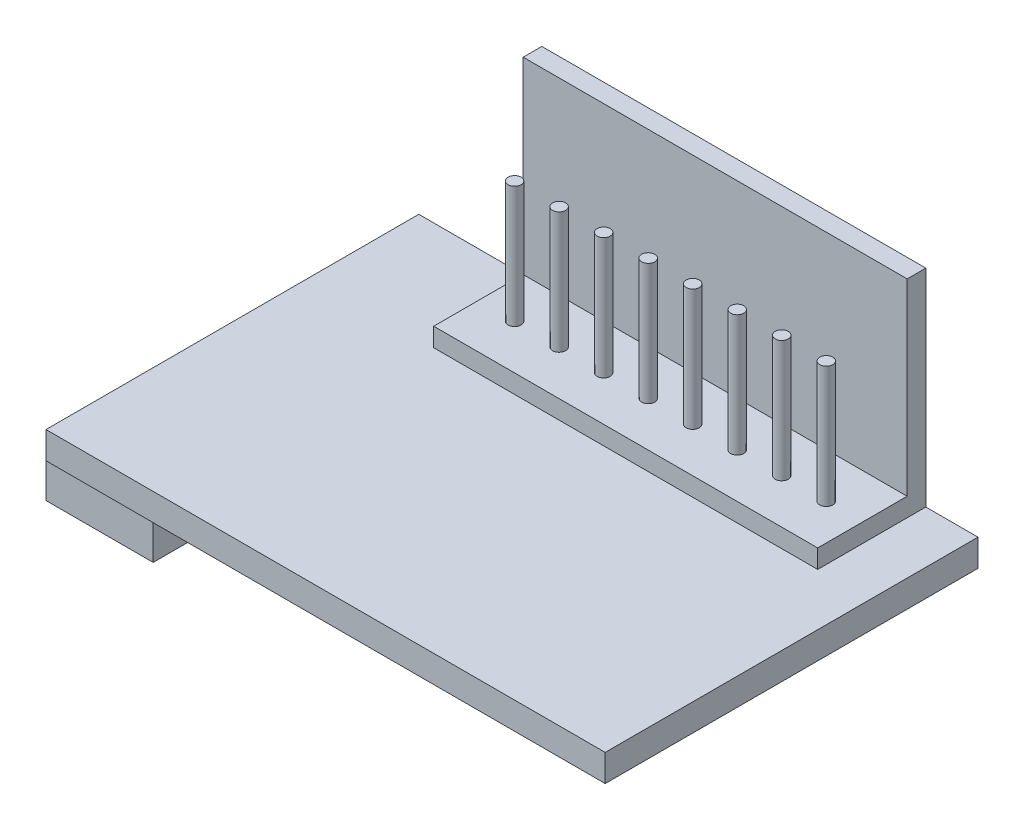
ISO-10303-21;
HEADER;
FILE_DESCRIPTION(('STEP AP214'),'2;1');
FILE_NAME('part.step','',(''),(''),'','','');
FILE_SCHEMA(('AUTOMOTIVE_DESIGN { 1 0 10303 214 1 1 1 1 }'));
ENDSEC;
DATA;
#1=APPLICATION_CONTEXT('core data for automotive mechanical design processes');
#2=APPLICATION_PROTOCOL_DEFINITION('international standard','automotive_design',2000,#1);
#3=PRODUCT_CONTEXT('',#1,'mechanical');
#4=PRODUCT('Part','Part','',(#3));
#5=PRODUCT_RELATED_PRODUCT_CATEGORY('part','',(#4));
#6=PRODUCT_DEFINITION_FORMATION('','',#4);
#7=PRODUCT_DEFINITION_CONTEXT('part definition',#1,'design');
#8=PRODUCT_DEFINITION('design','',#6,#7);
#9=PRODUCT_DEFINITION_SHAPE('','',#8);
#10=(LENGTH_UNIT() NAMED_UNIT(*) SI_UNIT(.MILLI.,.METRE.));
#11=(NAMED_UNIT(*) PLANE_ANGLE_UNIT() SI_UNIT($,.RADIAN.));
#12=(NAMED_UNIT(*) SI_UNIT($,.STERADIAN.) SOLID_ANGLE_UNIT());
#13=UNCERTAINTY_MEASURE_WITH_UNIT(LENGTH_MEASURE(1.E-05),#10,'distance_accuracy_value','');
#14=(GEOMETRIC_REPRESENTATION_CONTEXT(3) GLOBAL_UNCERTAINTY_ASSIGNED_CONTEXT((#13)) GLOBAL_UNIT_ASSIGNED_CONTEXT((#10,
#11,#12)) REPRESENTATION_CONTEXT('',''));
#15=CARTESIAN_POINT('',(0.,0.,0.));
#16=DIRECTION('',(0.,0.,1.));
#17=DIRECTION('',(1.,0.,0.));
#18=AXIS2_PLACEMENT_3D('',#15,#16,#17);
#19=CARTESIAN_POINT('',(25.2605506708399,8.97,-16.6));
#20=DIRECTION('',(0.,-1.,0.));
#21=DIRECTION('',(0.,0.,-1.));
#22=AXIS2_PLACEMENT_3D('',#19,#20,#21);
#23=CYLINDRICAL_SURFACE('',#22,0.350000000000001);
#24=CARTESIAN_POINT('',(25.2605506708399,8.97,-16.6));
#25=DIRECTION('',(0.,1.,0.));
#26=DIRECTION('',(0.,0.,1.));
#27=AXIS2_PLACEMENT_3D('',#24,#25,#26);
#28=CIRCLE('',#27,0.350000000000001);
#29=CARTESIAN_POINT('',(25.2605506708399,8.97,-16.25));
#30=VERTEX_POINT('',#29);
#31=EDGE_CURVE('E11',#30,#30,#28,.T.);
#32=ORIENTED_EDGE('',*,*,#31,.F.);
#33=EDGE_LOOP('',(#32));
#34=FACE_BOUND('',#33,.T.);
#35=CARTESIAN_POINT('',(25.2605506708399,2.45,-16.6));
#36=DIRECTION('',(0.,1.,0.));
#37=DIRECTION('',(0.,0.,1.));
#38=AXIS2_PLACEMENT_3D('',#35,#36,#37);
#39=CIRCLE('',#38,0.350000000000001);
#40=CARTESIAN_POINT('',(25.2605506708399,2.45,-16.25));
#41=VERTEX_POINT('',#40);
#42=EDGE_CURVE('E47',#41,#41,#39,.T.);
#43=ORIENTED_EDGE('',*,*,#42,.T.);
#44=EDGE_LOOP('',(#43));
#45=FACE_BOUND('',#44,.T.);
#46=ADVANCED_FACE('F44',(#34,#45),#23,.T.);
#47=CARTESIAN_POINT('',(25.2605506708399,8.97,-16.6));
#48=DIRECTION('',(0.,1.,0.));
#49=DIRECTION('',(0.,0.,1.));
#50=AXIS2_PLACEMENT_3D('',#47,#48,#49);
#51=PLANE('',#50);
#52=ORIENTED_EDGE('',*,*,#31,.T.);
#53=EDGE_LOOP('',(#52));
#54=FACE_BOUND('',#53,.T.);
#55=ADVANCED_FACE('F59',(#54),#51,.T.);
#56=CARTESIAN_POINT('',(25.2605506708399,2.45,-16.6));
#57=DIRECTION('',(0.,1.,0.));
#58=DIRECTION('',(0.,0.,1.));
#59=AXIS2_PLACEMENT_3D('',#56,#57,#58);
#60=PLANE('',#59);
#61=ORIENTED_EDGE('',*,*,#42,.F.);
#62=EDGE_LOOP('',(#61));
#63=FACE_BOUND('',#62,.T.);
#64=ADVANCED_FACE('F57',(#63),#60,.F.);
#65=CLOSED_SHELL('',(#46,#55,#64));
#66=MANIFOLD_SOLID_BREP('B2',#65);
#67=CARTESIAN_POINT('',(22.8718219077427,8.97,-16.6));
#68=DIRECTION('',(0.,-1.,0.));
#69=DIRECTION('',(0.,0.,-1.));
#70=AXIS2_PLACEMENT_3D('',#67,#68,#69);
#71=CYLINDRICAL_SURFACE('',#70,0.350000000000001);
#72=CARTESIAN_POINT('',(22.8718219077427,8.97,-16.6));
#73=DIRECTION('',(0.,1.,0.));
#74=DIRECTION('',(0.,0.,1.));
#75=AXIS2_PLACEMENT_3D('',#72,#73,#74);
#76=CIRCLE('',#75,0.350000000000001);
#77=CARTESIAN_POINT('',(22.8718219077427,8.97,-16.25));
#78=VERTEX_POINT('',#77);
#79=EDGE_CURVE('E43',#78,#78,#76,.T.);
#80=ORIENTED_EDGE('',*,*,#79,.F.);
#81=EDGE_LOOP('',(#80));
#82=FACE_BOUND('',#81,.T.);
#83=CARTESIAN_POINT('',(22.8718219077427,2.45,-16.6));
#84=DIRECTION('',(0.,1.,0.));
#85=DIRECTION('',(0.,0.,1.));
#86=AXIS2_PLACEMENT_3D('',#83,#84,#85);
#87=CIRCLE('',#86,0.350000000000001);
#88=CARTESIAN_POINT('',(22.8718219077427,2.45,-16.25));
#89=VERTEX_POINT('',#88);
#90=EDGE_CURVE('E96',#89,#89,#87,.T.);
#91=ORIENTED_EDGE('',*,*,#90,.T.);
#92=EDGE_LOOP('',(#91));
#93=FACE_BOUND('',#92,.T.);
#94=ADVANCED_FACE('F93',(#82,#93),#71,.T.);
#95=CARTESIAN_POINT('',(22.8718219077427,8.97,-16.6));
#96=DIRECTION('',(0.,1.,0.));
#97=DIRECTION('',(0.,0.,1.));
#98=AXIS2_PLACEMENT_3D('',#95,#96,#97);
#99=PLANE('',#98);
#100=ORIENTED_EDGE('',*,*,#79,.T.);
#101=EDGE_LOOP('',(#100));
#102=FACE_BOUND('',#101,.T.);
#103=ADVANCED_FACE('F108',(#102),#99,.T.);
#104=CARTESIAN_POINT('',(22.8718219077427,2.45,-16.6));
#105=DIRECTION('',(0.,1.,0.));
#106=DIRECTION('',(0.,0.,1.));
#107=AXIS2_PLACEMENT_3D('',#104,#105,#106);
#108=PLANE('',#107);
#109=ORIENTED_EDGE('',*,*,#90,.F.);
#110=EDGE_LOOP('',(#109));
#111=FACE_BOUND('',#110,.T.);
#112=ADVANCED_FACE('F106',(#111),#108,.F.);
#113=CLOSED_SHELL('',(#94,#103,#112));
#114=MANIFOLD_SOLID_BREP('B6',#113);
#115=CARTESIAN_POINT('',(20.4830931446457,8.97,-16.6));
#116=DIRECTION('',(0.,-1.,0.));
#117=DIRECTION('',(0.,0.,-1.));
#118=AXIS2_PLACEMENT_3D('',#115,#116,#117);
#119=CYLINDRICAL_SURFACE('',#118,0.350000000000001);
#120=CARTESIAN_POINT('',(20.4830931446457,8.97,-16.6));
#121=DIRECTION('',(0.,1.,0.));
#122=DIRECTION('',(0.,0.,1.));
#123=AXIS2_PLACEMENT_3D('',#120,#121,#122);
#124=CIRCLE('',#123,0.350000000000001);
#125=CARTESIAN_POINT('',(20.4830931446457,8.97,-16.25));
#126=VERTEX_POINT('',#125);
#127=EDGE_CURVE('E92',#126,#126,#124,.T.);
#128=ORIENTED_EDGE('',*,*,#127,.F.);
#129=EDGE_LOOP('',(#128));
#130=FACE_BOUND('',#129,.T.);
#131=CARTESIAN_POINT('',(20.4830931446457,2.45,-16.6));
#132=DIRECTION('',(0.,1.,0.));
#133=DIRECTION('',(0.,0.,1.));
#134=AXIS2_PLACEMENT_3D('',#131,#132,#133);
#135=CIRCLE('',#134,0.350000000000001);
#136=CARTESIAN_POINT('',(20.4830931446457,2.45,-16.25));
#137=VERTEX_POINT('',#136);
#138=EDGE_CURVE('E145',#137,#137,#135,.T.);
#139=ORIENTED_EDGE('',*,*,#138,.T.);
#140=EDGE_LOOP('',(#139));
#141=FACE_BOUND('',#140,.T.);
#142=ADVANCED_FACE('F142',(#130,#141),#119,.T.);
#143=CARTESIAN_POINT('',(20.4830931446457,8.97,-16.6));
#144=DIRECTION('',(0.,1.,0.));
#145=DIRECTION('',(0.,0.,1.));
#146=AXIS2_PLACEMENT_3D('',#143,#144,#145);
#147=PLANE('',#146);
#148=ORIENTED_EDGE('',*,*,#127,.T.);
#149=EDGE_LOOP('',(#148));
#150=FACE_BOUND('',#149,.T.);
#151=ADVANCED_FACE('F157',(#150),#147,.T.);
#152=CARTESIAN_POINT('',(20.4830931446457,2.45,-16.6));
#153=DIRECTION('',(0.,1.,0.));
#154=DIRECTION('',(0.,0.,1.));
#155=AXIS2_PLACEMENT_3D('',#152,#153,#154);
#156=PLANE('',#155);
#157=ORIENTED_EDGE('',*,*,#138,.F.);
#158=EDGE_LOOP('',(#157));
#159=FACE_BOUND('',#158,.T.);
#160=ADVANCED_FACE('F155',(#159),#156,.F.);
#161=CLOSED_SHELL('',(#142,#151,#160));
#162=MANIFOLD_SOLID_BREP('B38',#161);
#163=CARTESIAN_POINT('',(18.0943643815486,8.97,-16.6));
#164=DIRECTION('',(0.,-1.,0.));
#165=DIRECTION('',(0.,0.,-1.));
#166=AXIS2_PLACEMENT_3D('',#163,#164,#165);
#167=CYLINDRICAL_SURFACE('',#166,0.350000000000001);
#168=CARTESIAN_POINT('',(18.0943643815486,8.97,-16.6));
#169=DIRECTION('',(0.,1.,0.));
#170=DIRECTION('',(0.,0.,1.));
#171=AXIS2_PLACEMENT_3D('',#168,#169,#170);
#172=CIRCLE('',#171,0.350000000000001);
#173=CARTESIAN_POINT('',(18.0943643815486,8.97,-16.25));
#174=VERTEX_POINT('',#173);
#175=EDGE_CURVE('E141',#174,#174,#172,.T.);
#176=ORIENTED_EDGE('',*,*,#175,.F.);
#177=EDGE_LOOP('',(#176));
#178=FACE_BOUND('',#177,.T.);
#179=CARTESIAN_POINT('',(18.0943643815486,2.45,-16.6));
#180=DIRECTION('',(0.,1.,0.));
#181=DIRECTION('',(0.,0.,1.));
#182=AXIS2_PLACEMENT_3D('',#179,#180,#181);
#183=CIRCLE('',#182,0.350000000000001);
#184=CARTESIAN_POINT('',(18.0943643815486,2.45,-16.25));
#185=VERTEX_POINT('',#184);
#186=EDGE_CURVE('E194',#185,#185,#183,.T.);
#187=ORIENTED_EDGE('',*,*,#186,.T.);
#188=EDGE_LOOP('',(#187));
#189=FACE_BOUND('',#188,.T.);
#190=ADVANCED_FACE('F191',(#178,#189),#167,.T.);
#191=CARTESIAN_POINT('',(18.0943643815486,8.97,-16.6));
#192=DIRECTION('',(0.,1.,0.));
#193=DIRECTION('',(0.,0.,1.));
#194=AXIS2_PLACEMENT_3D('',#191,#192,#193);
#195=PLANE('',#194);
#196=ORIENTED_EDGE('',*,*,#175,.T.);
#197=EDGE_LOOP('',(#196));
#198=FACE_BOUND('',#197,.T.);
#199=ADVANCED_FACE('F206',(#198),#195,.T.);
#200=CARTESIAN_POINT('',(18.0943643815486,2.45,-16.6));
#201=DIRECTION('',(0.,1.,0.));
#202=DIRECTION('',(0.,0.,1.));
#203=AXIS2_PLACEMENT_3D('',#200,#201,#202);
#204=PLANE('',#203);
#205=ORIENTED_EDGE('',*,*,#186,.F.);
#206=EDGE_LOOP('',(#205));
#207=FACE_BOUND('',#206,.T.);
#208=ADVANCED_FACE('F204',(#207),#204,.F.);
#209=CLOSED_SHELL('',(#190,#199,#208));
#210=MANIFOLD_SOLID_BREP('B87',#209);
#211=CARTESIAN_POINT('',(15.7056356184514,8.97,-16.6));
#212=DIRECTION('',(0.,-1.,0.));
#213=DIRECTION('',(0.,0.,-1.));
#214=AXIS2_PLACEMENT_3D('',#211,#212,#213);
#215=CYLINDRICAL_SURFACE('',#214,0.350000000000001);
#216=CARTESIAN_POINT('',(15.7056356184514,8.97,-16.6));
#217=DIRECTION('',(0.,1.,0.));
#218=DIRECTION('',(0.,0.,1.));
#219=AXIS2_PLACEMENT_3D('',#216,#217,#218);
#220=CIRCLE('',#219,0.350000000000001);
#221=CARTESIAN_POINT('',(15.7056356184514,8.97,-16.25));
#222=VERTEX_POINT('',#221);
#223=EDGE_CURVE('E190',#222,#222,#220,.T.);
#224=ORIENTED_EDGE('',*,*,#223,.F.);
#225=EDGE_LOOP('',(#224));
#226=FACE_BOUND('',#225,.T.);
#227=CARTESIAN_POINT('',(15.7056356184514,2.45,-16.6));
#228=DIRECTION('',(0.,1.,0.));
#229=DIRECTION('',(0.,0.,1.));
#230=AXIS2_PLACEMENT_3D('',#227,#228,#229);
#231=CIRCLE('',#230,0.350000000000001);
#232=CARTESIAN_POINT('',(15.7056356184514,2.45,-16.25));
#233=VERTEX_POINT('',#232);
#234=EDGE_CURVE('E243',#233,#233,#231,.T.);
#235=ORIENTED_EDGE('',*,*,#234,.T.);
#236=EDGE_LOOP('',(#235));
#237=FACE_BOUND('',#236,.T.);
#238=ADVANCED_FACE('F240',(#226,#237),#215,.T.);
#239=CARTESIAN_POINT('',(15.7056356184514,8.97,-16.6));
#240=DIRECTION('',(0.,1.,0.));
#241=DIRECTION('',(0.,0.,1.));
#242=AXIS2_PLACEMENT_3D('',#239,#240,#241);
#243=PLANE('',#242);
#244=ORIENTED_EDGE('',*,*,#223,.T.);
#245=EDGE_LOOP('',(#244));
#246=FACE_BOUND('',#245,.T.);
#247=ADVANCED_FACE('F255',(#246),#243,.T.);
#248=CARTESIAN_POINT('',(15.7056356184514,2.45,-16.6));
#249=DIRECTION('',(0.,1.,0.));
#250=DIRECTION('',(0.,0.,1.));
#251=AXIS2_PLACEMENT_3D('',#248,#249,#250);
#252=PLANE('',#251);
#253=ORIENTED_EDGE('',*,*,#234,.F.);
#254=EDGE_LOOP('',(#253));
#255=FACE_BOUND('',#254,.T.);
#256=ADVANCED_FACE('F253',(#255),#252,.F.);
#257=CLOSED_SHELL('',(#238,#247,#256));
#258=MANIFOLD_SOLID_BREP('B136',#257);
#259=CARTESIAN_POINT('',(13.3169068553543,8.97,-16.6));
#260=DIRECTION('',(0.,-1.,0.));
#261=DIRECTION('',(0.,0.,-1.));
#262=AXIS2_PLACEMENT_3D('',#259,#260,#261);
#263=CYLINDRICAL_SURFACE('',#262,0.349999999999999);
#264=CARTESIAN_POINT('',(13.3169068553543,8.97,-16.6));
#265=DIRECTION('',(0.,1.,0.));
#266=DIRECTION('',(0.,0.,1.));
#267=AXIS2_PLACEMENT_3D('',#264,#265,#266);
#268=CIRCLE('',#267,0.349999999999999);
#269=CARTESIAN_POINT('',(13.3169068553543,8.97,-16.25));
#270=VERTEX_POINT('',#269);
#271=EDGE_CURVE('E239',#270,#270,#268,.T.);
#272=ORIENTED_EDGE('',*,*,#271,.F.);
#273=EDGE_LOOP('',(#272));
#274=FACE_BOUND('',#273,.T.);
#275=CARTESIAN_POINT('',(13.3169068553543,2.45,-16.6));
#276=DIRECTION('',(0.,1.,0.));
#277=DIRECTION('',(0.,0.,1.));
#278=AXIS2_PLACEMENT_3D('',#275,#276,#277);
#279=CIRCLE('',#278,0.349999999999999);
#280=CARTESIAN_POINT('',(13.3169068553543,2.45,-16.25));
#281=VERTEX_POINT('',#280);
#282=EDGE_CURVE('E292',#281,#281,#279,.T.);
#283=ORIENTED_EDGE('',*,*,#282,.T.);
#284=EDGE_LOOP('',(#283));
#285=FACE_BOUND('',#284,.T.);
#286=ADVANCED_FACE('F289',(#274,#285),#263,.T.);
#287=CARTESIAN_POINT('',(13.3169068553543,8.97,-16.6));
#288=DIRECTION('',(0.,1.,0.));
#289=DIRECTION('',(0.,0.,1.));
#290=AXIS2_PLACEMENT_3D('',#287,#288,#289);
#291=PLANE('',#290);
#292=ORIENTED_EDGE('',*,*,#271,.T.);
#293=EDGE_LOOP('',(#292));
#294=FACE_BOUND('',#293,.T.);
#295=ADVANCED_FACE('F304',(#294),#291,.T.);
#296=CARTESIAN_POINT('',(13.3169068553543,2.45,-16.6));
#297=DIRECTION('',(0.,1.,0.));
#298=DIRECTION('',(0.,0.,1.));
#299=AXIS2_PLACEMENT_3D('',#296,#297,#298);
#300=PLANE('',#299);
#301=ORIENTED_EDGE('',*,*,#282,.F.);
#302=EDGE_LOOP('',(#301));
#303=FACE_BOUND('',#302,.T.);
#304=ADVANCED_FACE('F302',(#303),#300,.F.);
#305=CLOSED_SHELL('',(#286,#295,#304));
#306=MANIFOLD_SOLID_BREP('B185',#305);
#307=CARTESIAN_POINT('',(10.9281780922572,8.97,-16.6));
#308=DIRECTION('',(0.,-1.,0.));
#309=DIRECTION('',(0.,0.,-1.));
#310=AXIS2_PLACEMENT_3D('',#307,#308,#309);
#311=CYLINDRICAL_SURFACE('',#310,0.349999999999999);
#312=CARTESIAN_POINT('',(10.9281780922572,8.97,-16.6));
#313=DIRECTION('',(0.,1.,0.));
#314=DIRECTION('',(0.,0.,1.));
#315=AXIS2_PLACEMENT_3D('',#312,#313,#314);
#316=CIRCLE('',#315,0.349999999999999);
#317=CARTESIAN_POINT('',(10.9281780922572,8.97,-16.25));
#318=VERTEX_POINT('',#317);
#319=EDGE_CURVE('E288',#318,#318,#316,.T.);
#320=ORIENTED_EDGE('',*,*,#319,.F.);
#321=EDGE_LOOP('',(#320));
#322=FACE_BOUND('',#321,.T.);
#323=CARTESIAN_POINT('',(10.9281780922572,2.45,-16.6));
#324=DIRECTION('',(0.,1.,0.));
#325=DIRECTION('',(0.,0.,1.));
#326=AXIS2_PLACEMENT_3D('',#323,#324,#325);
#327=CIRCLE('',#326,0.349999999999999);
#328=CARTESIAN_POINT('',(10.9281780922572,2.45,-16.25));
#329=VERTEX_POINT('',#328);
#330=EDGE_CURVE('E341',#329,#329,#327,.T.);
#331=ORIENTED_EDGE('',*,*,#330,.T.);
#332=EDGE_LOOP('',(#331));
#333=FACE_BOUND('',#332,.T.);
#334=ADVANCED_FACE('F338',(#322,#333),#311,.T.);
#335=CARTESIAN_POINT('',(10.9281780922572,8.97,-16.6));
#336=DIRECTION('',(0.,1.,0.));
#337=DIRECTION('',(0.,0.,1.));
#338=AXIS2_PLACEMENT_3D('',#335,#336,#337);
#339=PLANE('',#338);
#340=ORIENTED_EDGE('',*,*,#319,.T.);
#341=EDGE_LOOP('',(#340));
#342=FACE_BOUND('',#341,.T.);
#343=ADVANCED_FACE('F353',(#342),#339,.T.);
#344=CARTESIAN_POINT('',(10.9281780922572,2.45,-16.6));
#345=DIRECTION('',(0.,1.,0.));
#346=DIRECTION('',(0.,0.,1.));
#347=AXIS2_PLACEMENT_3D('',#344,#345,#346);
#348=PLANE('',#347);
#349=ORIENTED_EDGE('',*,*,#330,.F.);
#350=EDGE_LOOP('',(#349));
#351=FACE_BOUND('',#350,.T.);
#352=ADVANCED_FACE('F351',(#351),#348,.F.);
#353=CLOSED_SHELL('',(#334,#343,#352));
#354=MANIFOLD_SOLID_BREP('B234',#353);
#355=CARTESIAN_POINT('',(8.53944932916015,8.97,-16.6));
#356=DIRECTION('',(0.,-1.,0.));
#357=DIRECTION('',(0.,0.,-1.));
#358=AXIS2_PLACEMENT_3D('',#355,#356,#357);
#359=CYLINDRICAL_SURFACE('',#358,0.349999999999999);
#360=CARTESIAN_POINT('',(8.53944932916015,8.97,-16.6));
#361=DIRECTION('',(0.,1.,0.));
#362=DIRECTION('',(0.,0.,1.));
#363=AXIS2_PLACEMENT_3D('',#360,#361,#362);
#364=CIRCLE('',#363,0.349999999999999);
#365=CARTESIAN_POINT('',(8.53944932916015,8.97,-16.25));
#366=VERTEX_POINT('',#365);
#367=EDGE_CURVE('E337',#366,#366,#364,.T.);
#368=ORIENTED_EDGE('',*,*,#367,.F.);
#369=EDGE_LOOP('',(#368));
#370=FACE_BOUND('',#369,.T.);
#371=CARTESIAN_POINT('',(8.53944932916015,2.45,-16.6));
#372=DIRECTION('',(0.,1.,0.));
#373=DIRECTION('',(0.,0.,1.));
#374=AXIS2_PLACEMENT_3D('',#371,#372,#373);
#375=CIRCLE('',#374,0.349999999999999);
#376=CARTESIAN_POINT('',(8.53944932916015,2.45,-16.25));
#377=VERTEX_POINT('',#376);
#378=EDGE_CURVE('E392',#377,#377,#375,.T.);
#379=ORIENTED_EDGE('',*,*,#378,.T.);
#380=EDGE_LOOP('',(#379));
#381=FACE_BOUND('',#380,.T.);
#382=ADVANCED_FACE('F389',(#370,#381),#359,.T.);
#383=CARTESIAN_POINT('',(8.53944932916015,8.97,-16.6));
#384=DIRECTION('',(0.,1.,0.));
#385=DIRECTION('',(0.,0.,1.));
#386=AXIS2_PLACEMENT_3D('',#383,#384,#385);
#387=PLANE('',#386);
#388=ORIENTED_EDGE('',*,*,#367,.T.);
#389=EDGE_LOOP('',(#388));
#390=FACE_BOUND('',#389,.T.);
#391=ADVANCED_FACE('F404',(#390),#387,.T.);
#392=CARTESIAN_POINT('',(8.53944932916015,2.45,-16.6));
#393=DIRECTION('',(0.,1.,0.));
#394=DIRECTION('',(0.,0.,1.));
#395=AXIS2_PLACEMENT_3D('',#392,#393,#394);
#396=PLANE('',#395);
#397=ORIENTED_EDGE('',*,*,#378,.F.);
#398=EDGE_LOOP('',(#397));
#399=FACE_BOUND('',#398,.T.);
#400=ADVANCED_FACE('F402',(#399),#396,.F.);
#401=CLOSED_SHELL('',(#382,#391,#400));
#402=MANIFOLD_SOLID_BREP('B283',#401);
#403=CARTESIAN_POINT('',(-1.,-2.85,-1.));
#404=DIRECTION('',(1.,0.,0.));
#405=DIRECTION('',(0.,0.,-1.));
#406=AXIS2_PLACEMENT_3D('',#403,#404,#405);
#407=PLANE('',#406);
#408=DIRECTION('',(0.,0.,-1.));
#409=VECTOR('',#408,1.);
#410=CARTESIAN_POINT('',(-1.,0.,-1.));
#411=LINE('',#410,#409);
#412=CARTESIAN_POINT('',(-1.,0.,-1.));
#413=VERTEX_POINT('',#412);
#414=CARTESIAN_POINT('',(-0.999999999999998,0.,-16.5));
#415=VERTEX_POINT('',#414);
#416=EDGE_CURVE('E504',#413,#415,#411,.T.);
#417=ORIENTED_EDGE('',*,*,#416,.T.);
#418=DIRECTION('',(0.,1.,0.));
#419=VECTOR('',#418,1.);
#420=CARTESIAN_POINT('',(-0.999999999999998,-2.85,-16.5));
#421=LINE('',#420,#419);
#422=CARTESIAN_POINT('',(-0.999999999999998,-2.85,-16.5));
#423=VERTEX_POINT('',#422);
#424=EDGE_CURVE('E387',#423,#415,#421,.T.);
#425=ORIENTED_EDGE('',*,*,#424,.F.);
#426=DIRECTION('',(0.,0.,-1.));
#427=VECTOR('',#426,1.);
#428=CARTESIAN_POINT('',(-1.,-2.85,-1.));
#429=LINE('',#428,#427);
#430=CARTESIAN_POINT('',(-1.,-2.85,-1.));
#431=VERTEX_POINT('',#430);
#432=EDGE_CURVE('E492',#431,#423,#429,.T.);
#433=ORIENTED_EDGE('',*,*,#432,.F.);
#434=DIRECTION('',(0.,1.,0.));
#435=VECTOR('',#434,1.);
#436=CARTESIAN_POINT('',(-1.,-2.85,-1.));
#437=LINE('',#436,#435);
#438=EDGE_CURVE('E500',#431,#413,#437,.T.);
#439=ORIENTED_EDGE('',*,*,#438,.T.);
#440=EDGE_LOOP('',(#417,#425,#433,#439));
#441=FACE_BOUND('',#440,.T.);
#442=ADVANCED_FACE('F441',(#441),#407,.F.);
#443=CARTESIAN_POINT('',(-0.999999999999998,-2.85,-16.5));
#444=DIRECTION('',(0.,0.,1.));
#445=DIRECTION('',(1.,0.,0.));
#446=AXIS2_PLACEMENT_3D('',#443,#444,#445);
#447=PLANE('',#446);
#448=DIRECTION('',(1.,0.,0.));
#449=VECTOR('',#448,1.);
#450=CARTESIAN_POINT('',(-0.999999999999998,0.,-16.5));
#451=LINE('',#450,#449);
#452=CARTESIAN_POINT('',(4.75,0.,-16.5));
#453=VERTEX_POINT('',#452);
#454=EDGE_CURVE('E496',#415,#453,#451,.T.);
#455=ORIENTED_EDGE('',*,*,#454,.T.);
#456=DIRECTION('',(0.,1.,0.));
#457=VECTOR('',#456,1.);
#458=CARTESIAN_POINT('',(4.75,-2.85,-16.5));
#459=LINE('',#458,#457);
#460=CARTESIAN_POINT('',(4.75,-2.85,-16.5));
#461=VERTEX_POINT('',#460);
#462=EDGE_CURVE('E449',#461,#453,#459,.T.);
#463=ORIENTED_EDGE('',*,*,#462,.F.);
#464=DIRECTION('',(1.,0.,0.));
#465=VECTOR('',#464,1.);
#466=CARTESIAN_POINT('',(-0.999999999999998,-2.85,-16.5));
#467=LINE('',#466,#465);
#468=EDGE_CURVE('E487',#423,#461,#467,.T.);
#469=ORIENTED_EDGE('',*,*,#468,.F.);
#470=ORIENTED_EDGE('',*,*,#424,.T.);
#471=EDGE_LOOP('',(#455,#463,#469,#470));
#472=FACE_BOUND('',#471,.T.);
#473=ADVANCED_FACE('F495',(#472),#447,.F.);
#474=CARTESIAN_POINT('',(4.75,-2.85,-1.));
#475=DIRECTION('',(-1.,0.,0.));
#476=DIRECTION('',(0.,0.,1.));
#477=AXIS2_PLACEMENT_3D('',#474,#475,#476);
#478=PLANE('',#477);
#479=DIRECTION('',(0.,0.,1.));
#480=VECTOR('',#479,1.);
#481=CARTESIAN_POINT('',(4.75,0.,-1.));
#482=LINE('',#481,#480);
#483=CARTESIAN_POINT('',(4.75,0.,-1.));
#484=VERTEX_POINT('',#483);
#485=EDGE_CURVE('E474',#453,#484,#482,.T.);
#486=ORIENTED_EDGE('',*,*,#485,.T.);
#487=DIRECTION('',(0.,1.,0.));
#488=VECTOR('',#487,1.);
#489=CARTESIAN_POINT('',(4.75,-2.85,-1.));
#490=LINE('',#489,#488);
#491=CARTESIAN_POINT('',(4.75,-2.85,-1.));
#492=VERTEX_POINT('',#491);
#493=EDGE_CURVE('E497',#492,#484,#490,.T.);
#494=ORIENTED_EDGE('',*,*,#493,.F.);
#495=DIRECTION('',(0.,0.,1.));
#496=VECTOR('',#495,1.);
#497=CARTESIAN_POINT('',(4.75,-2.85,-1.));
#498=LINE('',#497,#496);
#499=EDGE_CURVE('E490',#461,#492,#498,.T.);
#500=ORIENTED_EDGE('',*,*,#499,.F.);
#501=ORIENTED_EDGE('',*,*,#462,.T.);
#502=EDGE_LOOP('',(#486,#494,#500,#501));
#503=FACE_BOUND('',#502,.T.);
#504=ADVANCED_FACE('F498',(#503),#478,.F.);
#505=CARTESIAN_POINT('',(-1.,-2.85,-1.));
#506=DIRECTION('',(0.,0.,-1.));
#507=DIRECTION('',(-1.,0.,0.));
#508=AXIS2_PLACEMENT_3D('',#505,#506,#507);
#509=PLANE('',#508);
#510=DIRECTION('',(-1.,0.,0.));
#511=VECTOR('',#510,1.);
#512=CARTESIAN_POINT('',(-1.,0.,-1.));
#513=LINE('',#512,#511);
#514=EDGE_CURVE('E480',#484,#413,#513,.T.);
#515=ORIENTED_EDGE('',*,*,#514,.T.);
#516=ORIENTED_EDGE('',*,*,#438,.F.);
#517=DIRECTION('',(-1.,0.,0.));
#518=VECTOR('',#517,1.);
#519=CARTESIAN_POINT('',(-1.,-2.85,-1.));
#520=LINE('',#519,#518);
#521=EDGE_CURVE('E457',#492,#431,#520,.T.);
#522=ORIENTED_EDGE('',*,*,#521,.F.);
#523=ORIENTED_EDGE('',*,*,#493,.T.);
#524=EDGE_LOOP('',(#515,#516,#522,#523));
#525=FACE_BOUND('',#524,.T.);
#526=ADVANCED_FACE('F511',(#525),#509,.F.);
#527=CARTESIAN_POINT('',(0.,-2.85,0.));
#528=DIRECTION('',(0.,-1.,0.));
#529=DIRECTION('',(0.,0.,-1.));
#530=AXIS2_PLACEMENT_3D('',#527,#528,#529);
#531=PLANE('',#530);
#532=ORIENTED_EDGE('',*,*,#432,.T.);
#533=ORIENTED_EDGE('',*,*,#468,.T.);
#534=ORIENTED_EDGE('',*,*,#499,.T.);
#535=ORIENTED_EDGE('',*,*,#521,.T.);
#536=EDGE_LOOP('',(#532,#533,#534,#535));
#537=FACE_BOUND('',#536,.T.);
#538=ADVANCED_FACE('F488',(#537),#531,.T.);
#539=CARTESIAN_POINT('',(0.,0.,0.));
#540=DIRECTION('',(0.,-1.,0.));
#541=DIRECTION('',(0.,0.,-1.));
#542=AXIS2_PLACEMENT_3D('',#539,#540,#541);
#543=PLANE('',#542);
#544=ORIENTED_EDGE('',*,*,#416,.F.);
#545=ORIENTED_EDGE('',*,*,#514,.F.);
#546=ORIENTED_EDGE('',*,*,#485,.F.);
#547=ORIENTED_EDGE('',*,*,#454,.F.);
#548=EDGE_LOOP('',(#544,#545,#546,#547));
#549=FACE_BOUND('',#548,.T.);
#550=ADVANCED_FACE('F514',(#549),#543,.F.);
#551=CLOSED_SHELL('',(#442,#473,#504,#526,#538,#550));
#552=MANIFOLD_SOLID_BREP('B332',#551);
#553=CARTESIAN_POINT('',(0.,12.55,0.));
#554=DIRECTION('',(0.,1.,0.));
#555=DIRECTION('',(0.,0.,1.));
#556=AXIS2_PLACEMENT_3D('',#553,#554,#555);
#557=PLANE('',#556);
#558=DIRECTION('',(0.,0.,1.));
#559=VECTOR('',#558,1.);
#560=CARTESIAN_POINT('',(6.6,12.55,-20.));
#561=LINE('',#560,#559);
#562=CARTESIAN_POINT('',(6.6,12.55,-20.));
#563=VERTEX_POINT('',#562);
#564=CARTESIAN_POINT('',(6.6,12.55,-19.));
#565=VERTEX_POINT('',#564);
#566=EDGE_CURVE('E627',#563,#565,#561,.T.);
#567=ORIENTED_EDGE('',*,*,#566,.T.);
#568=DIRECTION('',(1.,0.,0.));
#569=VECTOR('',#568,1.);
#570=CARTESIAN_POINT('',(6.6,12.55,-19.));
#571=LINE('',#570,#569);
#572=CARTESIAN_POINT('',(27.2,12.55,-19.));
#573=VERTEX_POINT('',#572);
#574=EDGE_CURVE('E674',#565,#573,#571,.T.);
#575=ORIENTED_EDGE('',*,*,#574,.T.);
#576=DIRECTION('',(0.,0.,-1.));
#577=VECTOR('',#576,1.);
#578=CARTESIAN_POINT('',(27.2,12.55,-20.));
#579=LINE('',#578,#577);
#580=CARTESIAN_POINT('',(27.2,12.55,-20.));
#581=VERTEX_POINT('',#580);
#582=EDGE_CURVE('E679',#573,#581,#579,.T.);
#583=ORIENTED_EDGE('',*,*,#582,.T.);
#584=DIRECTION('',(-1.,0.,0.));
#585=VECTOR('',#584,1.);
#586=CARTESIAN_POINT('',(6.6,12.55,-20.));
#587=LINE('',#586,#585);
#588=EDGE_CURVE('E599',#581,#563,#587,.T.);
#589=ORIENTED_EDGE('',*,*,#588,.T.);
#590=EDGE_LOOP('',(#567,#575,#583,#589));
#591=FACE_BOUND('',#590,.T.);
#592=ADVANCED_FACE('F575',(#591),#557,.T.);
#593=CARTESIAN_POINT('',(6.6,12.55,-20.));
#594=DIRECTION('',(1.,0.,0.));
#595=DIRECTION('',(0.,0.,-1.));
#596=AXIS2_PLACEMENT_3D('',#593,#594,#595);
#597=PLANE('',#596);
#598=DIRECTION('',(0.,-1.,0.));
#599=VECTOR('',#598,1.);
#600=CARTESIAN_POINT('',(6.6,12.55,-14.2));
#601=LINE('',#600,#599);
#602=CARTESIAN_POINT('',(6.6,2.45,-14.2));
#603=VERTEX_POINT('',#602);
#604=CARTESIAN_POINT('',(6.6,1.45,-14.2));
#605=VERTEX_POINT('',#604);
#606=EDGE_CURVE('E439',#603,#605,#601,.T.);
#607=ORIENTED_EDGE('',*,*,#606,.F.);
#608=DIRECTION('',(0.,0.,1.));
#609=VECTOR('',#608,1.);
#610=CARTESIAN_POINT('',(6.6,2.45,-42.9427548476638));
#611=LINE('',#610,#609);
#612=CARTESIAN_POINT('',(6.6,2.45,-19.));
#613=VERTEX_POINT('',#612);
#614=EDGE_CURVE('E666',#613,#603,#611,.T.);
#615=ORIENTED_EDGE('',*,*,#614,.F.);
#616=DIRECTION('',(0.,1.,0.));
#617=VECTOR('',#616,1.);
#618=CARTESIAN_POINT('',(6.6,12.55,-19.));
#619=LINE('',#618,#617);
#620=EDGE_CURVE('E644',#613,#565,#619,.T.);
#621=ORIENTED_EDGE('',*,*,#620,.T.);
#622=ORIENTED_EDGE('',*,*,#566,.F.);
#623=DIRECTION('',(0.,-1.,0.));
#624=VECTOR('',#623,1.);
#625=CARTESIAN_POINT('',(6.6,12.55,-20.));
#626=LINE('',#625,#624);
#627=CARTESIAN_POINT('',(6.6,1.45,-20.));
#628=VERTEX_POINT('',#627);
#629=EDGE_CURVE('E620',#563,#628,#626,.T.);
#630=ORIENTED_EDGE('',*,*,#629,.T.);
#631=DIRECTION('',(0.,0.,1.));
#632=VECTOR('',#631,1.);
#633=CARTESIAN_POINT('',(6.6,1.45,-20.));
#634=LINE('',#633,#632);
#635=EDGE_CURVE('E633',#628,#605,#634,.T.);
#636=ORIENTED_EDGE('',*,*,#635,.T.);
#637=EDGE_LOOP('',(#607,#615,#621,#622,#630,#636));
#638=FACE_BOUND('',#637,.T.);
#639=ADVANCED_FACE('F577',(#638),#597,.F.);
#640=CARTESIAN_POINT('',(6.6,12.55,-14.2));
#641=DIRECTION('',(0.,0.,-1.));
#642=DIRECTION('',(-1.,0.,0.));
#643=AXIS2_PLACEMENT_3D('',#640,#641,#642);
#644=PLANE('',#643);
#645=DIRECTION('',(0.,-1.,0.));
#646=VECTOR('',#645,1.);
#647=CARTESIAN_POINT('',(27.2,12.55,-14.2));
#648=LINE('',#647,#646);
#649=CARTESIAN_POINT('',(27.2,2.45,-14.2));
#650=VERTEX_POINT('',#649);
#651=CARTESIAN_POINT('',(27.2,1.45,-14.2));
#652=VERTEX_POINT('',#651);
#653=EDGE_CURVE('E583',#650,#652,#648,.T.);
#654=ORIENTED_EDGE('',*,*,#653,.F.);
#655=DIRECTION('',(1.,0.,0.));
#656=VECTOR('',#655,1.);
#657=CARTESIAN_POINT('',(6.6,2.45,-14.2));
#658=LINE('',#657,#656);
#659=EDGE_CURVE('E662',#603,#650,#658,.T.);
#660=ORIENTED_EDGE('',*,*,#659,.F.);
#661=ORIENTED_EDGE('',*,*,#606,.T.);
#662=DIRECTION('',(1.,0.,0.));
#663=VECTOR('',#662,1.);
#664=CARTESIAN_POINT('',(6.6,1.45,-14.2));
#665=LINE('',#664,#663);
#666=EDGE_CURVE('E639',#605,#652,#665,.T.);
#667=ORIENTED_EDGE('',*,*,#666,.T.);
#668=EDGE_LOOP('',(#654,#660,#661,#667));
#669=FACE_BOUND('',#668,.T.);
#670=ADVANCED_FACE('F659',(#669),#644,.F.);
#671=CARTESIAN_POINT('',(27.2,12.55,-20.));
#672=DIRECTION('',(-1.,0.,0.));
#673=DIRECTION('',(0.,0.,1.));
#674=AXIS2_PLACEMENT_3D('',#671,#672,#673);
#675=PLANE('',#674);
#676=DIRECTION('',(0.,-1.,0.));
#677=VECTOR('',#676,1.);
#678=CARTESIAN_POINT('',(27.2,12.55,-19.));
#679=LINE('',#678,#677);
#680=CARTESIAN_POINT('',(27.2,2.45,-19.));
#681=VERTEX_POINT('',#680);
#682=EDGE_CURVE('E590',#573,#681,#679,.T.);
#683=ORIENTED_EDGE('',*,*,#682,.T.);
#684=DIRECTION('',(0.,0.,1.));
#685=VECTOR('',#684,1.);
#686=CARTESIAN_POINT('',(27.2,2.45,-42.9427548476638));
#687=LINE('',#686,#685);
#688=EDGE_CURVE('E656',#681,#650,#687,.T.);
#689=ORIENTED_EDGE('',*,*,#688,.T.);
#690=ORIENTED_EDGE('',*,*,#653,.T.);
#691=DIRECTION('',(0.,0.,-1.));
#692=VECTOR('',#691,1.);
#693=CARTESIAN_POINT('',(27.2,1.45,-20.));
#694=LINE('',#693,#692);
#695=CARTESIAN_POINT('',(27.2,1.45,-20.));
#696=VERTEX_POINT('',#695);
#697=EDGE_CURVE('E628',#652,#696,#694,.T.);
#698=ORIENTED_EDGE('',*,*,#697,.T.);
#699=DIRECTION('',(0.,-1.,0.));
#700=VECTOR('',#699,1.);
#701=CARTESIAN_POINT('',(27.2,12.55,-20.));
#702=LINE('',#701,#700);
#703=EDGE_CURVE('E623',#581,#696,#702,.T.);
#704=ORIENTED_EDGE('',*,*,#703,.F.);
#705=ORIENTED_EDGE('',*,*,#582,.F.);
#706=EDGE_LOOP('',(#683,#689,#690,#698,#704,#705));
#707=FACE_BOUND('',#706,.T.);
#708=ADVANCED_FACE('F653',(#707),#675,.F.);
#709=CARTESIAN_POINT('',(6.6,12.55,-20.));
#710=DIRECTION('',(0.,0.,1.));
#711=DIRECTION('',(1.,0.,0.));
#712=AXIS2_PLACEMENT_3D('',#709,#710,#711);
#713=PLANE('',#712);
#714=DIRECTION('',(-1.,0.,0.));
#715=VECTOR('',#714,1.);
#716=CARTESIAN_POINT('',(6.6,1.45,-20.));
#717=LINE('',#716,#715);
#718=EDGE_CURVE('E617',#696,#628,#717,.T.);
#719=ORIENTED_EDGE('',*,*,#718,.T.);
#720=ORIENTED_EDGE('',*,*,#629,.F.);
#721=ORIENTED_EDGE('',*,*,#588,.F.);
#722=ORIENTED_EDGE('',*,*,#703,.T.);
#723=EDGE_LOOP('',(#719,#720,#721,#722));
#724=FACE_BOUND('',#723,.T.);
#725=ADVANCED_FACE('F619',(#724),#713,.F.);
#726=CARTESIAN_POINT('',(0.,1.45,0.));
#727=DIRECTION('',(0.,1.,0.));
#728=DIRECTION('',(0.,0.,1.));
#729=AXIS2_PLACEMENT_3D('',#726,#727,#728);
#730=PLANE('',#729);
#731=ORIENTED_EDGE('',*,*,#635,.F.);
#732=ORIENTED_EDGE('',*,*,#718,.F.);
#733=ORIENTED_EDGE('',*,*,#697,.F.);
#734=ORIENTED_EDGE('',*,*,#666,.F.);
#735=EDGE_LOOP('',(#731,#732,#733,#734));
#736=FACE_BOUND('',#735,.T.);
#737=ADVANCED_FACE('F637',(#736),#730,.F.);
#738=CARTESIAN_POINT('',(6.6,2.45,-42.9427548476638));
#739=DIRECTION('',(0.,-1.,0.));
#740=DIRECTION('',(1.,0.,0.));
#741=AXIS2_PLACEMENT_3D('',#738,#739,#740);
#742=PLANE('',#741);
#743=DIRECTION('',(-1.,0.,0.));
#744=VECTOR('',#743,1.);
#745=CARTESIAN_POINT('',(6.6,2.45,-19.));
#746=LINE('',#745,#744);
#747=EDGE_CURVE('E640',#681,#613,#746,.T.);
#748=ORIENTED_EDGE('',*,*,#747,.T.);
#749=ORIENTED_EDGE('',*,*,#614,.T.);
#750=ORIENTED_EDGE('',*,*,#659,.T.);
#751=ORIENTED_EDGE('',*,*,#688,.F.);
#752=EDGE_LOOP('',(#748,#749,#750,#751));
#753=FACE_BOUND('',#752,.T.);
#754=ADVANCED_FACE('F685',(#753),#742,.F.);
#755=CARTESIAN_POINT('',(6.6,12.55,-19.));
#756=DIRECTION('',(0.,0.,1.));
#757=DIRECTION('',(1.,0.,0.));
#758=AXIS2_PLACEMENT_3D('',#755,#756,#757);
#759=PLANE('',#758);
#760=ORIENTED_EDGE('',*,*,#620,.F.);
#761=ORIENTED_EDGE('',*,*,#747,.F.);
#762=ORIENTED_EDGE('',*,*,#682,.F.);
#763=ORIENTED_EDGE('',*,*,#574,.F.);
#764=EDGE_LOOP('',(#760,#761,#762,#763));
#765=FACE_BOUND('',#764,.T.);
#766=ADVANCED_FACE('F675',(#765),#759,.T.);
#767=CLOSED_SHELL('',(#592,#639,#670,#708,#725,#737,#754,#766));
#768=MANIFOLD_SOLID_BREP('B381',#767);
#769=CARTESIAN_POINT('',(0.,1.45,0.));
#770=DIRECTION('',(1.,0.,0.));
#771=DIRECTION('',(0.,0.,-1.));
#772=AXIS2_PLACEMENT_3D('',#769,#770,#771);
#773=PLANE('',#772);
#774=DIRECTION('',(0.,0.,1.));
#775=VECTOR('',#774,1.);
#776=CARTESIAN_POINT('',(0.,0.,0.));
#777=LINE('',#776,#775);
#778=CARTESIAN_POINT('',(0.,0.,-20.));
#779=VERTEX_POINT('',#778);
#780=CARTESIAN_POINT('',(0.,0.,0.));
#781=VERTEX_POINT('',#780);
#782=EDGE_CURVE('E814',#779,#781,#777,.T.);
#783=ORIENTED_EDGE('',*,*,#782,.T.);
#784=DIRECTION('',(0.,-1.,0.));
#785=VECTOR('',#784,1.);
#786=CARTESIAN_POINT('',(0.,1.45,0.));
#787=LINE('',#786,#785);
#788=CARTESIAN_POINT('',(0.,1.45,0.));
#789=VERTEX_POINT('',#788);
#790=EDGE_CURVE('E573',#789,#781,#787,.T.);
#791=ORIENTED_EDGE('',*,*,#790,.F.);
#792=DIRECTION('',(0.,0.,1.));
#793=VECTOR('',#792,1.);
#794=CARTESIAN_POINT('',(0.,1.45,0.));
#795=LINE('',#794,#793);
#796=CARTESIAN_POINT('',(0.,1.45,-20.));
#797=VERTEX_POINT('',#796);
#798=EDGE_CURVE('E802',#797,#789,#795,.T.);
#799=ORIENTED_EDGE('',*,*,#798,.F.);
#800=DIRECTION('',(0.,-1.,0.));
#801=VECTOR('',#800,1.);
#802=CARTESIAN_POINT('',(0.,1.45,-20.));
#803=LINE('',#802,#801);
#804=EDGE_CURVE('E810',#797,#779,#803,.T.);
#805=ORIENTED_EDGE('',*,*,#804,.T.);
#806=EDGE_LOOP('',(#783,#791,#799,#805));
#807=FACE_BOUND('',#806,.T.);
#808=ADVANCED_FACE('F751',(#807),#773,.F.);
#809=CARTESIAN_POINT('',(0.,1.45,0.));
#810=DIRECTION('',(0.,0.,-1.));
#811=DIRECTION('',(-1.,0.,0.));
#812=AXIS2_PLACEMENT_3D('',#809,#810,#811);
#813=PLANE('',#812);
#814=DIRECTION('',(1.,0.,0.));
#815=VECTOR('',#814,1.);
#816=CARTESIAN_POINT('',(0.,0.,0.));
#817=LINE('',#816,#815);
#818=CARTESIAN_POINT('',(30.,0.,0.));
#819=VERTEX_POINT('',#818);
#820=EDGE_CURVE('E806',#781,#819,#817,.T.);
#821=ORIENTED_EDGE('',*,*,#820,.T.);
#822=DIRECTION('',(0.,-1.,0.));
#823=VECTOR('',#822,1.);
#824=CARTESIAN_POINT('',(30.,1.45,0.));
#825=LINE('',#824,#823);
#826=CARTESIAN_POINT('',(30.,1.45,0.));
#827=VERTEX_POINT('',#826);
#828=EDGE_CURVE('E759',#827,#819,#825,.T.);
#829=ORIENTED_EDGE('',*,*,#828,.F.);
#830=DIRECTION('',(1.,0.,0.));
#831=VECTOR('',#830,1.);
#832=CARTESIAN_POINT('',(0.,1.45,0.));
#833=LINE('',#832,#831);
#834=EDGE_CURVE('E797',#789,#827,#833,.T.);
#835=ORIENTED_EDGE('',*,*,#834,.F.);
#836=ORIENTED_EDGE('',*,*,#790,.T.);
#837=EDGE_LOOP('',(#821,#829,#835,#836));
#838=FACE_BOUND('',#837,.T.);
#839=ADVANCED_FACE('F805',(#838),#813,.F.);
#840=CARTESIAN_POINT('',(30.,1.45,0.));
#841=DIRECTION('',(-1.,0.,0.));
#842=DIRECTION('',(0.,0.,1.));
#843=AXIS2_PLACEMENT_3D('',#840,#841,#842);
#844=PLANE('',#843);
#845=DIRECTION('',(0.,0.,-1.));
#846=VECTOR('',#845,1.);
#847=CARTESIAN_POINT('',(30.,0.,0.));
#848=LINE('',#847,#846);
#849=CARTESIAN_POINT('',(30.,0.,-20.));
#850=VERTEX_POINT('',#849);
#851=EDGE_CURVE('E784',#819,#850,#848,.T.);
#852=ORIENTED_EDGE('',*,*,#851,.T.);
#853=DIRECTION('',(0.,-1.,0.));
#854=VECTOR('',#853,1.);
#855=CARTESIAN_POINT('',(30.,1.45,-20.));
#856=LINE('',#855,#854);
#857=CARTESIAN_POINT('',(30.,1.45,-20.));
#858=VERTEX_POINT('',#857);
#859=EDGE_CURVE('E807',#858,#850,#856,.T.);
#860=ORIENTED_EDGE('',*,*,#859,.F.);
#861=DIRECTION('',(0.,0.,-1.));
#862=VECTOR('',#861,1.);
#863=CARTESIAN_POINT('',(30.,1.45,0.));
#864=LINE('',#863,#862);
#865=EDGE_CURVE('E800',#827,#858,#864,.T.);
#866=ORIENTED_EDGE('',*,*,#865,.F.);
#867=ORIENTED_EDGE('',*,*,#828,.T.);
#868=EDGE_LOOP('',(#852,#860,#866,#867));
#869=FACE_BOUND('',#868,.T.);
#870=ADVANCED_FACE('F808',(#869),#844,.F.);
#871=CARTESIAN_POINT('',(0.,1.45,-20.));
#872=DIRECTION('',(0.,0.,1.));
#873=DIRECTION('',(1.,0.,0.));
#874=AXIS2_PLACEMENT_3D('',#871,#872,#873);
#875=PLANE('',#874);
#876=DIRECTION('',(-1.,0.,0.));
#877=VECTOR('',#876,1.);
#878=CARTESIAN_POINT('',(0.,0.,-20.));
#879=LINE('',#878,#877);
#880=EDGE_CURVE('E790',#850,#779,#879,.T.);
#881=ORIENTED_EDGE('',*,*,#880,.T.);
#882=ORIENTED_EDGE('',*,*,#804,.F.);
#883=DIRECTION('',(-1.,0.,0.));
#884=VECTOR('',#883,1.);
#885=CARTESIAN_POINT('',(0.,1.45,-20.));
#886=LINE('',#885,#884);
#887=EDGE_CURVE('E767',#858,#797,#886,.T.);
#888=ORIENTED_EDGE('',*,*,#887,.F.);
#889=ORIENTED_EDGE('',*,*,#859,.T.);
#890=EDGE_LOOP('',(#881,#882,#888,#889));
#891=FACE_BOUND('',#890,.T.);
#892=ADVANCED_FACE('F821',(#891),#875,.F.);
#893=CARTESIAN_POINT('',(0.,1.45,0.));
#894=DIRECTION('',(0.,-1.,0.));
#895=DIRECTION('',(0.,0.,-1.));
#896=AXIS2_PLACEMENT_3D('',#893,#894,#895);
#897=PLANE('',#896);
#898=ORIENTED_EDGE('',*,*,#798,.T.);
#899=ORIENTED_EDGE('',*,*,#834,.T.);
#900=ORIENTED_EDGE('',*,*,#865,.T.);
#901=ORIENTED_EDGE('',*,*,#887,.T.);
#902=EDGE_LOOP('',(#898,#899,#900,#901));
#903=FACE_BOUND('',#902,.T.);
#904=ADVANCED_FACE('F798',(#903),#897,.F.);
#905=CARTESIAN_POINT('',(0.,0.,0.));
#906=DIRECTION('',(0.,-1.,0.));
#907=DIRECTION('',(0.,0.,-1.));
#908=AXIS2_PLACEMENT_3D('',#905,#906,#907);
#909=PLANE('',#908);
#910=ORIENTED_EDGE('',*,*,#782,.F.);
#911=ORIENTED_EDGE('',*,*,#880,.F.);
#912=ORIENTED_EDGE('',*,*,#851,.F.);
#913=ORIENTED_EDGE('',*,*,#820,.F.);
#914=EDGE_LOOP('',(#910,#911,#912,#913));
#915=FACE_BOUND('',#914,.T.);
#916=ADVANCED_FACE('F824',(#915),#909,.T.);
#917=CLOSED_SHELL('',(#808,#839,#870,#892,#904,#916));
#918=MANIFOLD_SOLID_BREP('B433',#917);
#919=ADVANCED_BREP_SHAPE_REPRESENTATION('',(#18,#66,#114,#162,#210,#258,#306,#354,#402,#552,
#768,#918),#14);
#920=SHAPE_DEFINITION_REPRESENTATION(#9,#919);
ENDSEC;
END-ISO-10303-21;
